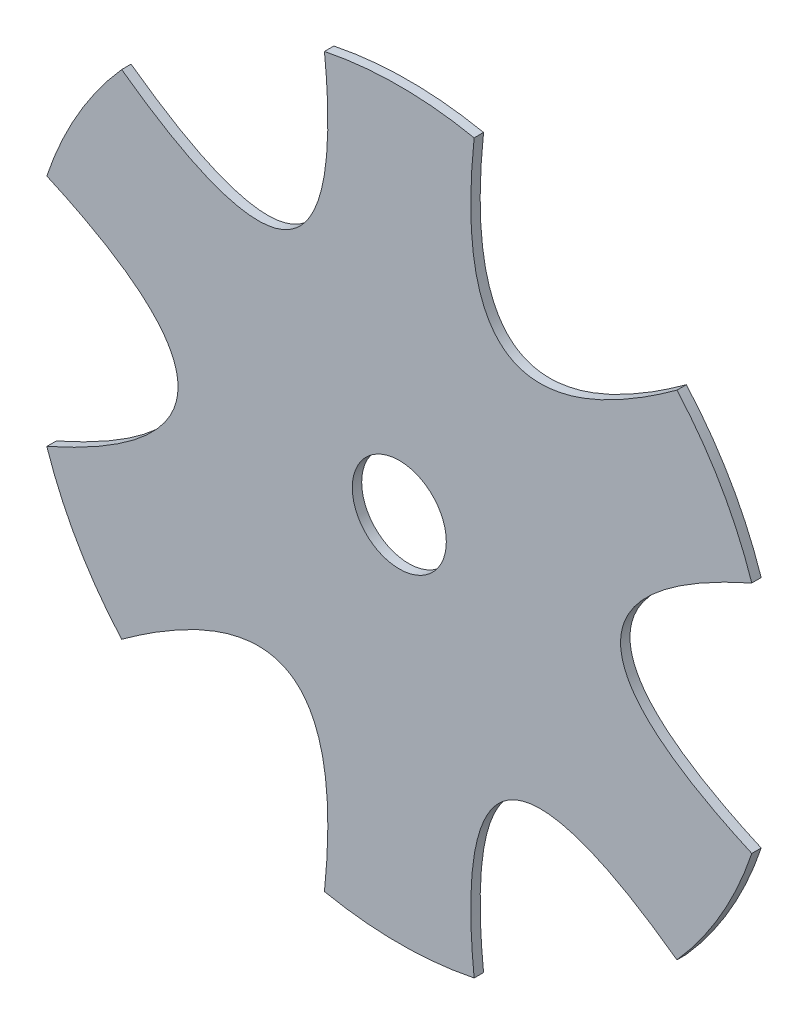
ISO-10303-21;
HEADER;
FILE_DESCRIPTION(('STEP AP214'),'2;1');
FILE_NAME('part.step','',(''),(''),'','','');
FILE_SCHEMA(('AUTOMOTIVE_DESIGN { 1 0 10303 214 1 1 1 1 }'));
ENDSEC;
DATA;
#1=APPLICATION_CONTEXT('core data for automotive mechanical design processes');
#2=APPLICATION_PROTOCOL_DEFINITION('international standard','automotive_design',2000,#1);
#3=PRODUCT_CONTEXT('',#1,'mechanical');
#4=PRODUCT('Part','Part','',(#3));
#5=PRODUCT_RELATED_PRODUCT_CATEGORY('part','',(#4));
#6=PRODUCT_DEFINITION_FORMATION('','',#4);
#7=PRODUCT_DEFINITION_CONTEXT('part definition',#1,'design');
#8=PRODUCT_DEFINITION('design','',#6,#7);
#9=PRODUCT_DEFINITION_SHAPE('','',#8);
#10=(LENGTH_UNIT() NAMED_UNIT(*) SI_UNIT(.MILLI.,.METRE.));
#11=(NAMED_UNIT(*) PLANE_ANGLE_UNIT() SI_UNIT($,.RADIAN.));
#12=(NAMED_UNIT(*) SI_UNIT($,.STERADIAN.) SOLID_ANGLE_UNIT());
#13=UNCERTAINTY_MEASURE_WITH_UNIT(LENGTH_MEASURE(1.E-05),#10,'distance_accuracy_value','');
#14=(GEOMETRIC_REPRESENTATION_CONTEXT(3) GLOBAL_UNCERTAINTY_ASSIGNED_CONTEXT((#13)) GLOBAL_UNIT_ASSIGNED_CONTEXT((#10,
#11,#12)) REPRESENTATION_CONTEXT('',''));
#15=CARTESIAN_POINT('',(0.,0.,0.));
#16=DIRECTION('',(0.,0.,1.));
#17=DIRECTION('',(1.,0.,0.));
#18=AXIS2_PLACEMENT_3D('',#15,#16,#17);
#19=CARTESIAN_POINT('',(0.,0.,3.175));
#20=DIRECTION('',(0.,0.,-1.));
#21=DIRECTION('',(-1.,0.,0.));
#22=AXIS2_PLACEMENT_3D('',#19,#20,#21);
#23=CYLINDRICAL_SURFACE('',#22,125.4125);
#24=CARTESIAN_POINT('',(0.,0.,3.175));
#25=DIRECTION('',(0.,0.,1.));
#26=DIRECTION('',(1.,0.,0.));
#27=AXIS2_PLACEMENT_3D('',#24,#25,#26);
#28=CIRCLE('',#27,125.4125);
#29=CARTESIAN_POINT('',(-93.7481476383955,83.3041413773625,3.175));
#30=VERTEX_POINT('',#29);
#31=CARTESIAN_POINT('',(-119.017576492444,39.5362067239028,3.175));
#32=VERTEX_POINT('',#31);
#33=EDGE_CURVE('E50',#30,#32,#28,.T.);
#34=ORIENTED_EDGE('',*,*,#33,.F.);
#35=DIRECTION('',(0.,0.,1.));
#36=VECTOR('',#35,1.);
#37=CARTESIAN_POINT('',(-93.7481476383955,83.3041413773625,0.));
#38=LINE('',#37,#36);
#39=CARTESIAN_POINT('',(-93.7481476383955,83.3041413773625,0.));
#40=VERTEX_POINT('',#39);
#41=EDGE_CURVE('E134',#40,#30,#38,.T.);
#42=ORIENTED_EDGE('',*,*,#41,.F.);
#43=CARTESIAN_POINT('',(0.,0.,0.));
#44=DIRECTION('',(0.,0.,1.));
#45=DIRECTION('',(1.,0.,0.));
#46=AXIS2_PLACEMENT_3D('',#43,#44,#45);
#47=CIRCLE('',#46,125.4125);
#48=CARTESIAN_POINT('',(-119.017576492444,39.5362067239028,0.));
#49=VERTEX_POINT('',#48);
#50=EDGE_CURVE('E148',#40,#49,#47,.T.);
#51=ORIENTED_EDGE('',*,*,#50,.T.);
#52=DIRECTION('',(0.,0.,1.));
#53=VECTOR('',#52,1.);
#54=CARTESIAN_POINT('',(-119.017576492444,39.5362067239028,0.));
#55=LINE('',#54,#53);
#56=EDGE_CURVE('E253',#49,#32,#55,.T.);
#57=ORIENTED_EDGE('',*,*,#56,.T.);
#58=EDGE_LOOP('',(#34,#42,#51,#57));
#59=FACE_BOUND('',#58,.T.);
#60=ADVANCED_FACE('F41',(#59),#23,.T.);
#61=CARTESIAN_POINT('',(-119.017576492444,-39.5362067239036,3.175));
#62=VERTEX_POINT('',#61);
#63=CARTESIAN_POINT('',(-93.7481476383955,-83.3041413773625,3.175));
#64=VERTEX_POINT('',#63);
#65=EDGE_CURVE('E244',#62,#64,#28,.T.);
#66=ORIENTED_EDGE('',*,*,#65,.F.);
#67=DIRECTION('',(0.,0.,1.));
#68=VECTOR('',#67,1.);
#69=CARTESIAN_POINT('',(-119.017576492444,-39.5362067239036,0.));
#70=LINE('',#69,#68);
#71=CARTESIAN_POINT('',(-119.017576492444,-39.5362067239036,0.));
#72=VERTEX_POINT('',#71);
#73=EDGE_CURVE('E251',#72,#62,#70,.T.);
#74=ORIENTED_EDGE('',*,*,#73,.F.);
#75=CARTESIAN_POINT('',(-93.7481476383955,-83.3041413773625,0.));
#76=VERTEX_POINT('',#75);
#77=EDGE_CURVE('E156',#72,#76,#47,.T.);
#78=ORIENTED_EDGE('',*,*,#77,.T.);
#79=DIRECTION('',(0.,0.,1.));
#80=VECTOR('',#79,1.);
#81=CARTESIAN_POINT('',(-93.7481476383955,-83.3041413773625,0.));
#82=LINE('',#81,#80);
#83=EDGE_CURVE('E295',#76,#64,#82,.T.);
#84=ORIENTED_EDGE('',*,*,#83,.T.);
#85=EDGE_LOOP('',(#66,#74,#78,#84));
#86=FACE_BOUND('',#85,.T.);
#87=ADVANCED_FACE('F220',(#86),#23,.T.);
#88=CARTESIAN_POINT('',(-25.2694288540489,-122.840348101266,3.175));
#89=VERTEX_POINT('',#88);
#90=CARTESIAN_POINT('',(25.2694288540497,-122.840348101266,3.175));
#91=VERTEX_POINT('',#90);
#92=EDGE_CURVE('E240',#89,#91,#28,.T.);
#93=ORIENTED_EDGE('',*,*,#92,.F.);
#94=DIRECTION('',(0.,0.,1.));
#95=VECTOR('',#94,1.);
#96=CARTESIAN_POINT('',(-25.2694288540489,-122.840348101266,0.));
#97=LINE('',#96,#95);
#98=CARTESIAN_POINT('',(-25.2694288540489,-122.840348101266,0.));
#99=VERTEX_POINT('',#98);
#100=EDGE_CURVE('E304',#99,#89,#97,.T.);
#101=ORIENTED_EDGE('',*,*,#100,.F.);
#102=CARTESIAN_POINT('',(25.2694288540498,-122.840348101266,0.));
#103=VERTEX_POINT('',#102);
#104=EDGE_CURVE('E159',#99,#103,#47,.T.);
#105=ORIENTED_EDGE('',*,*,#104,.T.);
#106=DIRECTION('',(0.,0.,1.));
#107=VECTOR('',#106,1.);
#108=CARTESIAN_POINT('',(25.2694288540497,-122.840348101266,0.));
#109=LINE('',#108,#107);
#110=EDGE_CURVE('E66',#103,#91,#109,.T.);
#111=ORIENTED_EDGE('',*,*,#110,.T.);
#112=EDGE_LOOP('',(#93,#101,#105,#111));
#113=FACE_BOUND('',#112,.T.);
#114=ADVANCED_FACE('F224',(#113),#23,.T.);
#115=CARTESIAN_POINT('',(93.748147638396,-83.3041413773619,3.175));
#116=VERTEX_POINT('',#115);
#117=CARTESIAN_POINT('',(119.017576492445,-39.5362067239019,3.175));
#118=VERTEX_POINT('',#117);
#119=EDGE_CURVE('E238',#116,#118,#28,.T.);
#120=ORIENTED_EDGE('',*,*,#119,.F.);
#121=DIRECTION('',(0.,0.,1.));
#122=VECTOR('',#121,1.);
#123=CARTESIAN_POINT('',(93.748147638396,-83.3041413773619,0.));
#124=LINE('',#123,#122);
#125=CARTESIAN_POINT('',(93.748147638396,-83.3041413773619,0.));
#126=VERTEX_POINT('',#125);
#127=EDGE_CURVE('E303',#126,#116,#124,.T.);
#128=ORIENTED_EDGE('',*,*,#127,.F.);
#129=CARTESIAN_POINT('',(119.017576492445,-39.536206723902,0.));
#130=VERTEX_POINT('',#129);
#131=EDGE_CURVE('E164',#126,#130,#47,.T.);
#132=ORIENTED_EDGE('',*,*,#131,.T.);
#133=DIRECTION('',(0.,0.,1.));
#134=VECTOR('',#133,1.);
#135=CARTESIAN_POINT('',(119.017576492445,-39.5362067239019,0.));
#136=LINE('',#135,#134);
#137=EDGE_CURVE('E58',#130,#118,#136,.T.);
#138=ORIENTED_EDGE('',*,*,#137,.T.);
#139=EDGE_LOOP('',(#120,#128,#132,#138));
#140=FACE_BOUND('',#139,.T.);
#141=ADVANCED_FACE('F232',(#140),#23,.T.);
#142=CARTESIAN_POINT('',(119.017576492444,39.5362067239045,3.175));
#143=VERTEX_POINT('',#142);
#144=CARTESIAN_POINT('',(93.7481476383955,83.3041413773625,3.175));
#145=VERTEX_POINT('',#144);
#146=EDGE_CURVE('E51',#143,#145,#28,.T.);
#147=ORIENTED_EDGE('',*,*,#146,.F.);
#148=DIRECTION('',(0.,0.,1.));
#149=VECTOR('',#148,1.);
#150=CARTESIAN_POINT('',(119.017576492444,39.5362067239045,0.));
#151=LINE('',#150,#149);
#152=CARTESIAN_POINT('',(119.017576492444,39.5362067239045,0.));
#153=VERTEX_POINT('',#152);
#154=EDGE_CURVE('E235',#153,#143,#151,.T.);
#155=ORIENTED_EDGE('',*,*,#154,.F.);
#156=CARTESIAN_POINT('',(93.7481476383955,83.3041413773625,0.));
#157=VERTEX_POINT('',#156);
#158=EDGE_CURVE('E157',#153,#157,#47,.T.);
#159=ORIENTED_EDGE('',*,*,#158,.T.);
#160=DIRECTION('',(0.,0.,1.));
#161=VECTOR('',#160,1.);
#162=CARTESIAN_POINT('',(93.7481476383955,83.3041413773625,0.));
#163=LINE('',#162,#161);
#164=EDGE_CURVE('E178',#157,#145,#163,.T.);
#165=ORIENTED_EDGE('',*,*,#164,.T.);
#166=EDGE_LOOP('',(#147,#155,#159,#165));
#167=FACE_BOUND('',#166,.T.);
#168=ADVANCED_FACE('F226',(#167),#23,.T.);
#169=CARTESIAN_POINT('',(25.2694288540489,122.840348101266,0.));
#170=VERTEX_POINT('',#169);
#171=CARTESIAN_POINT('',(-25.2694288540489,122.840348101266,0.));
#172=VERTEX_POINT('',#171);
#173=EDGE_CURVE('E45',#170,#172,#47,.T.);
#174=ORIENTED_EDGE('',*,*,#173,.T.);
#175=DIRECTION('',(0.,0.,1.));
#176=VECTOR('',#175,1.);
#177=CARTESIAN_POINT('',(-25.2694288540489,122.840348101266,0.));
#178=LINE('',#177,#176);
#179=CARTESIAN_POINT('',(-25.2694288540489,122.840348101266,3.175));
#180=VERTEX_POINT('',#179);
#181=EDGE_CURVE('E137',#172,#180,#178,.T.);
#182=ORIENTED_EDGE('',*,*,#181,.T.);
#183=CARTESIAN_POINT('',(25.2694288540489,122.840348101266,3.175));
#184=VERTEX_POINT('',#183);
#185=EDGE_CURVE('E11',#184,#180,#28,.T.);
#186=ORIENTED_EDGE('',*,*,#185,.F.);
#187=DIRECTION('',(0.,0.,1.));
#188=VECTOR('',#187,1.);
#189=CARTESIAN_POINT('',(25.2694288540489,122.840348101266,0.));
#190=LINE('',#189,#188);
#191=EDGE_CURVE('E172',#170,#184,#190,.T.);
#192=ORIENTED_EDGE('',*,*,#191,.F.);
#193=EDGE_LOOP('',(#174,#182,#186,#192));
#194=FACE_BOUND('',#193,.T.);
#195=ADVANCED_FACE('F43',(#194),#23,.T.);
#196=CARTESIAN_POINT('',(0.,0.,3.175));
#197=DIRECTION('',(0.,0.,1.));
#198=DIRECTION('',(1.,0.,0.));
#199=AXIS2_PLACEMENT_3D('',#196,#197,#198);
#200=PLANE('',#199);
#201=CARTESIAN_POINT('',(0.,0.,3.175));
#202=DIRECTION('',(0.,0.,1.));
#203=DIRECTION('',(1.,0.,0.));
#204=AXIS2_PLACEMENT_3D('',#201,#202,#203);
#205=CIRCLE('',#204,15.875);
#206=CARTESIAN_POINT('',(15.875,0.,3.175));
#207=VERTEX_POINT('',#206);
#208=EDGE_CURVE('E336',#207,#207,#205,.T.);
#209=ORIENTED_EDGE('',*,*,#208,.F.);
#210=EDGE_LOOP('',(#209));
#211=FACE_BOUND('',#210,.T.);
#212=CARTESIAN_POINT('',(-93.7481476383955,83.3041413773625,3.175));
#213=CARTESIAN_POINT('',(-15.2065768776896,26.3385637613603,3.175));
#214=CARTESIAN_POINT('',(-25.2694288540489,122.840348101266,3.175));
#215=B_SPLINE_CURVE_WITH_KNOTS('',2,(#212,#213,#214),.UNSPECIFIED.,.F.,.F.,(3,3),(0.,1.),.UNSPECIFIED.);
#216=EDGE_CURVE('E142',#30,#180,#215,.T.);
#217=ORIENTED_EDGE('',*,*,#216,.F.);
#218=ORIENTED_EDGE('',*,*,#33,.T.);
#219=CARTESIAN_POINT('',(-119.017576492444,-39.5362067239036,3.175));
#220=CARTESIAN_POINT('',(-30.413153755379,-1.17961196366423E-13,3.175));
#221=CARTESIAN_POINT('',(-119.017576492444,39.5362067239028,3.175));
#222=B_SPLINE_CURVE_WITH_KNOTS('',2,(#219,#220,#221),.UNSPECIFIED.,.F.,.F.,(3,3),(0.,1.),.UNSPECIFIED.);
#223=EDGE_CURVE('E250',#62,#32,#222,.T.);
#224=ORIENTED_EDGE('',*,*,#223,.F.);
#225=ORIENTED_EDGE('',*,*,#65,.T.);
#226=CARTESIAN_POINT('',(-25.2694288540489,-122.840348101266,3.175));
#227=CARTESIAN_POINT('',(-15.2065768776895,-26.3385637613603,3.175));
#228=CARTESIAN_POINT('',(-93.7481476383955,-83.3041413773625,3.175));
#229=B_SPLINE_CURVE_WITH_KNOTS('',2,(#226,#227,#228),.UNSPECIFIED.,.F.,.F.,(3,3),(0.,1.),.UNSPECIFIED.);
#230=EDGE_CURVE('E296',#89,#64,#229,.T.);
#231=ORIENTED_EDGE('',*,*,#230,.F.);
#232=ORIENTED_EDGE('',*,*,#92,.T.);
#233=CARTESIAN_POINT('',(93.7481476383961,-83.3041413773619,3.175));
#234=CARTESIAN_POINT('',(15.2065768776897,-26.3385637613602,3.175));
#235=CARTESIAN_POINT('',(25.2694288540497,-122.840348101266,3.175));
#236=B_SPLINE_CURVE_WITH_KNOTS('',2,(#233,#234,#235),.UNSPECIFIED.,.F.,.F.,(3,3),(0.,1.),.UNSPECIFIED.);
#237=EDGE_CURVE('E314',#116,#91,#236,.T.);
#238=ORIENTED_EDGE('',*,*,#237,.F.);
#239=ORIENTED_EDGE('',*,*,#119,.T.);
#240=CARTESIAN_POINT('',(119.017576492444,39.5362067239045,3.175));
#241=CARTESIAN_POINT('',(30.413153755379,3.3133218391157E-13,3.175));
#242=CARTESIAN_POINT('',(119.017576492445,-39.5362067239019,3.175));
#243=B_SPLINE_CURVE_WITH_KNOTS('',2,(#240,#241,#242),.UNSPECIFIED.,.F.,.F.,(3,3),(0.,1.),.UNSPECIFIED.);
#244=EDGE_CURVE('E330',#143,#118,#243,.T.);
#245=ORIENTED_EDGE('',*,*,#244,.F.);
#246=ORIENTED_EDGE('',*,*,#146,.T.);
#247=CARTESIAN_POINT('',(25.2694288540489,122.840348101266,3.175));
#248=CARTESIAN_POINT('',(15.2065768776895,26.3385637613603,3.175));
#249=CARTESIAN_POINT('',(93.7481476383955,83.3041413773625,3.175));
#250=B_SPLINE_CURVE_WITH_KNOTS('',2,(#247,#248,#249),.UNSPECIFIED.,.F.,.F.,(3,3),(0.,1.),.UNSPECIFIED.);
#251=EDGE_CURVE('E150',#184,#145,#250,.T.);
#252=ORIENTED_EDGE('',*,*,#251,.F.);
#253=ORIENTED_EDGE('',*,*,#185,.T.);
#254=EDGE_LOOP('',(#217,#218,#224,#225,#231,#232,#238,#239,#245,#246,#252,#253));
#255=FACE_BOUND('',#254,.T.);
#256=ADVANCED_FACE('F210',(#211,#255),#200,.T.);
#257=CARTESIAN_POINT('',(0.,0.,0.));
#258=DIRECTION('',(0.,0.,1.));
#259=DIRECTION('',(1.,0.,0.));
#260=AXIS2_PLACEMENT_3D('',#257,#258,#259);
#261=PLANE('',#260);
#262=CARTESIAN_POINT('',(0.,0.,0.));
#263=DIRECTION('',(0.,0.,-1.));
#264=DIRECTION('',(-1.,0.,0.));
#265=AXIS2_PLACEMENT_3D('',#262,#263,#264);
#266=CIRCLE('',#265,15.875);
#267=CARTESIAN_POINT('',(-15.875,0.,0.));
#268=VERTEX_POINT('',#267);
#269=EDGE_CURVE('E433',#268,#268,#266,.T.);
#270=ORIENTED_EDGE('',*,*,#269,.F.);
#271=EDGE_LOOP('',(#270));
#272=FACE_BOUND('',#271,.T.);
#273=ORIENTED_EDGE('',*,*,#50,.F.);
#274=CARTESIAN_POINT('',(-93.7481476383955,83.3041413773625,0.));
#275=CARTESIAN_POINT('',(-15.2065768776896,26.3385637613603,0.));
#276=CARTESIAN_POINT('',(-25.2694288540489,122.840348101266,0.));
#277=B_SPLINE_CURVE_WITH_KNOTS('',2,(#274,#275,#276),.UNSPECIFIED.,.F.,.F.,(3,3),(0.,1.),.UNSPECIFIED.);
#278=EDGE_CURVE('E131',#40,#172,#277,.T.);
#279=ORIENTED_EDGE('',*,*,#278,.T.);
#280=ORIENTED_EDGE('',*,*,#173,.F.);
#281=CARTESIAN_POINT('',(25.2694288540489,122.840348101266,0.));
#282=CARTESIAN_POINT('',(15.2065768776895,26.3385637613603,0.));
#283=CARTESIAN_POINT('',(93.7481476383955,83.3041413773625,0.));
#284=B_SPLINE_CURVE_WITH_KNOTS('',2,(#281,#282,#283),.UNSPECIFIED.,.F.,.F.,(3,3),(0.,1.),.UNSPECIFIED.);
#285=EDGE_CURVE('E184',#170,#157,#284,.T.);
#286=ORIENTED_EDGE('',*,*,#285,.T.);
#287=ORIENTED_EDGE('',*,*,#158,.F.);
#288=CARTESIAN_POINT('',(119.017576492444,39.5362067239045,0.));
#289=CARTESIAN_POINT('',(30.413153755379,3.3133218391157E-13,0.));
#290=CARTESIAN_POINT('',(119.017576492445,-39.5362067239019,0.));
#291=B_SPLINE_CURVE_WITH_KNOTS('',2,(#288,#289,#290),.UNSPECIFIED.,.F.,.F.,(3,3),(0.,1.),.UNSPECIFIED.);
#292=EDGE_CURVE('E325',#153,#130,#291,.T.);
#293=ORIENTED_EDGE('',*,*,#292,.T.);
#294=ORIENTED_EDGE('',*,*,#131,.F.);
#295=CARTESIAN_POINT('',(93.7481476383961,-83.3041413773619,0.));
#296=CARTESIAN_POINT('',(15.2065768776897,-26.3385637613602,0.));
#297=CARTESIAN_POINT('',(25.2694288540497,-122.840348101266,0.));
#298=B_SPLINE_CURVE_WITH_KNOTS('',2,(#295,#296,#297),.UNSPECIFIED.,.F.,.F.,(3,3),(0.,1.),.UNSPECIFIED.);
#299=EDGE_CURVE('E309',#126,#103,#298,.T.);
#300=ORIENTED_EDGE('',*,*,#299,.T.);
#301=ORIENTED_EDGE('',*,*,#104,.F.);
#302=CARTESIAN_POINT('',(-25.2694288540489,-122.840348101266,0.));
#303=CARTESIAN_POINT('',(-15.2065768776895,-26.3385637613603,0.));
#304=CARTESIAN_POINT('',(-93.7481476383955,-83.3041413773625,0.));
#305=B_SPLINE_CURVE_WITH_KNOTS('',2,(#302,#303,#304),.UNSPECIFIED.,.F.,.F.,(3,3),(0.,1.),.UNSPECIFIED.);
#306=EDGE_CURVE('E288',#99,#76,#305,.T.);
#307=ORIENTED_EDGE('',*,*,#306,.T.);
#308=ORIENTED_EDGE('',*,*,#77,.F.);
#309=CARTESIAN_POINT('',(-119.017576492444,-39.5362067239036,0.));
#310=CARTESIAN_POINT('',(-30.413153755379,-1.17961196366423E-13,0.));
#311=CARTESIAN_POINT('',(-119.017576492444,39.5362067239028,0.));
#312=B_SPLINE_CURVE_WITH_KNOTS('',2,(#309,#310,#311),.UNSPECIFIED.,.F.,.F.,(3,3),(0.,1.),.UNSPECIFIED.);
#313=EDGE_CURVE('E155',#72,#49,#312,.T.);
#314=ORIENTED_EDGE('',*,*,#313,.T.);
#315=EDGE_LOOP('',(#273,#279,#280,#286,#287,#293,#294,#300,#301,#307,#308,#314));
#316=FACE_BOUND('',#315,.T.);
#317=ADVANCED_FACE('F153',(#272,#316),#261,.F.);
#318=DIRECTION('',(0.,0.,1.));
#319=VECTOR('',#318,1.);
#320=SURFACE_OF_LINEAR_EXTRUSION('',#284,#319);
#321=ORIENTED_EDGE('',*,*,#251,.T.);
#322=ORIENTED_EDGE('',*,*,#164,.F.);
#323=ORIENTED_EDGE('',*,*,#285,.F.);
#324=ORIENTED_EDGE('',*,*,#191,.T.);
#325=EDGE_LOOP('',(#321,#322,#323,#324));
#326=FACE_BOUND('',#325,.T.);
#327=ADVANCED_FACE('F203',(#326),#320,.F.);
#328=DIRECTION('',(0.,0.,1.));
#329=VECTOR('',#328,1.);
#330=SURFACE_OF_LINEAR_EXTRUSION('',#291,#329);
#331=ORIENTED_EDGE('',*,*,#244,.T.);
#332=ORIENTED_EDGE('',*,*,#137,.F.);
#333=ORIENTED_EDGE('',*,*,#292,.F.);
#334=ORIENTED_EDGE('',*,*,#154,.T.);
#335=EDGE_LOOP('',(#331,#332,#333,#334));
#336=FACE_BOUND('',#335,.T.);
#337=ADVANCED_FACE('F207',(#336),#330,.F.);
#338=DIRECTION('',(0.,0.,1.));
#339=VECTOR('',#338,1.);
#340=SURFACE_OF_LINEAR_EXTRUSION('',#298,#339);
#341=ORIENTED_EDGE('',*,*,#237,.T.);
#342=ORIENTED_EDGE('',*,*,#110,.F.);
#343=ORIENTED_EDGE('',*,*,#299,.F.);
#344=ORIENTED_EDGE('',*,*,#127,.T.);
#345=EDGE_LOOP('',(#341,#342,#343,#344));
#346=FACE_BOUND('',#345,.T.);
#347=ADVANCED_FACE('F285',(#346),#340,.F.);
#348=DIRECTION('',(0.,0.,1.));
#349=VECTOR('',#348,1.);
#350=SURFACE_OF_LINEAR_EXTRUSION('',#305,#349);
#351=ORIENTED_EDGE('',*,*,#230,.T.);
#352=ORIENTED_EDGE('',*,*,#83,.F.);
#353=ORIENTED_EDGE('',*,*,#306,.F.);
#354=ORIENTED_EDGE('',*,*,#100,.T.);
#355=EDGE_LOOP('',(#351,#352,#353,#354));
#356=FACE_BOUND('',#355,.T.);
#357=ADVANCED_FACE('F280',(#356),#350,.F.);
#358=DIRECTION('',(0.,0.,1.));
#359=VECTOR('',#358,1.);
#360=SURFACE_OF_LINEAR_EXTRUSION('',#312,#359);
#361=ORIENTED_EDGE('',*,*,#223,.T.);
#362=ORIENTED_EDGE('',*,*,#56,.F.);
#363=ORIENTED_EDGE('',*,*,#313,.F.);
#364=ORIENTED_EDGE('',*,*,#73,.T.);
#365=EDGE_LOOP('',(#361,#362,#363,#364));
#366=FACE_BOUND('',#365,.T.);
#367=ADVANCED_FACE('F276',(#366),#360,.F.);
#368=DIRECTION('',(0.,0.,1.));
#369=VECTOR('',#368,1.);
#370=SURFACE_OF_LINEAR_EXTRUSION('',#277,#369);
#371=ORIENTED_EDGE('',*,*,#216,.T.);
#372=ORIENTED_EDGE('',*,*,#181,.F.);
#373=ORIENTED_EDGE('',*,*,#278,.F.);
#374=ORIENTED_EDGE('',*,*,#41,.T.);
#375=EDGE_LOOP('',(#371,#372,#373,#374));
#376=FACE_BOUND('',#375,.T.);
#377=ADVANCED_FACE('F133',(#376),#370,.F.);
#378=CARTESIAN_POINT('',(0.,0.,50.8));
#379=DIRECTION('',(0.,0.,-1.));
#380=DIRECTION('',(-1.,0.,0.));
#381=AXIS2_PLACEMENT_3D('',#378,#379,#380);
#382=CYLINDRICAL_SURFACE('',#381,15.875);
#383=ORIENTED_EDGE('',*,*,#208,.T.);
#384=EDGE_LOOP('',(#383));
#385=FACE_BOUND('',#384,.T.);
#386=ORIENTED_EDGE('',*,*,#269,.T.);
#387=EDGE_LOOP('',(#386));
#388=FACE_BOUND('',#387,.T.);
#389=ADVANCED_FACE('F381',(#385,#388),#382,.F.);
#390=CLOSED_SHELL('',(#60,#87,#114,#141,#168,#195,#256,#317,#327,#337,#347,#357,#367,#377,#389));
#391=MANIFOLD_SOLID_BREP('B2',#390);
#392=ADVANCED_BREP_SHAPE_REPRESENTATION('',(#18,#391),#14);
#393=SHAPE_DEFINITION_REPRESENTATION(#9,#392);
ENDSEC;
END-ISO-10303-21;
